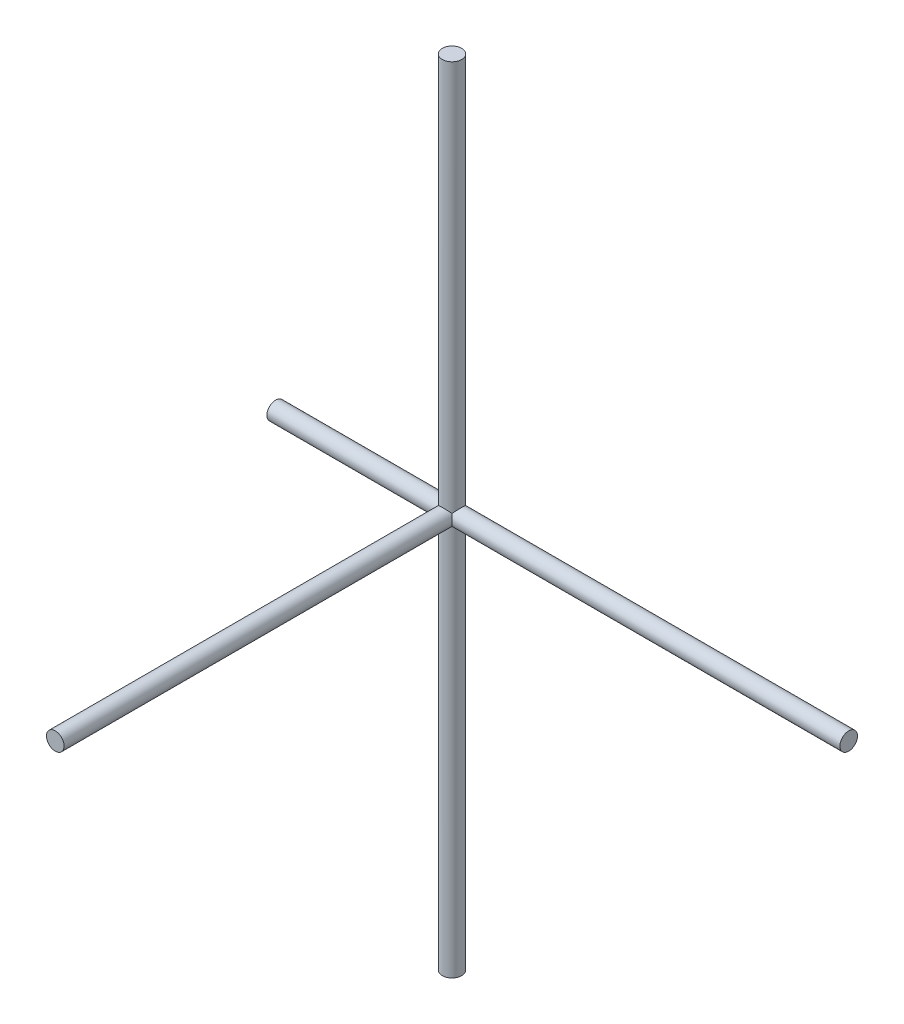
ISO-10303-21;
HEADER;
FILE_DESCRIPTION(('STEP AP214'),'2;1');
FILE_NAME('part.step','',(''),(''),'','','');
FILE_SCHEMA(('AUTOMOTIVE_DESIGN { 1 0 10303 214 1 1 1 1 }'));
ENDSEC;
DATA;
#1=APPLICATION_CONTEXT('core data for automotive mechanical design processes');
#2=APPLICATION_PROTOCOL_DEFINITION('international standard','automotive_design',2000,#1);
#3=PRODUCT_CONTEXT('',#1,'mechanical');
#4=PRODUCT('Part','Part','',(#3));
#5=PRODUCT_RELATED_PRODUCT_CATEGORY('part','',(#4));
#6=PRODUCT_DEFINITION_FORMATION('','',#4);
#7=PRODUCT_DEFINITION_CONTEXT('part definition',#1,'design');
#8=PRODUCT_DEFINITION('design','',#6,#7);
#9=PRODUCT_DEFINITION_SHAPE('','',#8);
#10=(LENGTH_UNIT() NAMED_UNIT(*) SI_UNIT(.MILLI.,.METRE.));
#11=(NAMED_UNIT(*) PLANE_ANGLE_UNIT() SI_UNIT($,.RADIAN.));
#12=(NAMED_UNIT(*) SI_UNIT($,.STERADIAN.) SOLID_ANGLE_UNIT());
#13=UNCERTAINTY_MEASURE_WITH_UNIT(LENGTH_MEASURE(1.E-05),#10,'distance_accuracy_value','');
#14=(GEOMETRIC_REPRESENTATION_CONTEXT(3) GLOBAL_UNCERTAINTY_ASSIGNED_CONTEXT((#13)) GLOBAL_UNIT_ASSIGNED_CONTEXT((#10,
#11,#12)) REPRESENTATION_CONTEXT('',''));
#15=CARTESIAN_POINT('',(0.,0.,0.));
#16=DIRECTION('',(0.,0.,1.));
#17=DIRECTION('',(1.,0.,0.));
#18=AXIS2_PLACEMENT_3D('',#15,#16,#17);
#19=CARTESIAN_POINT('',(0.,180.,0.));
#20=DIRECTION('',(0.,-1.,0.));
#21=DIRECTION('',(0.,0.,-1.));
#22=AXIS2_PLACEMENT_3D('',#19,#20,#21);
#23=CYLINDRICAL_SURFACE('',#22,4.4);
#24=CARTESIAN_POINT('',(0.,180.,0.));
#25=DIRECTION('',(0.,1.,0.));
#26=DIRECTION('',(0.,0.,1.));
#27=AXIS2_PLACEMENT_3D('',#24,#25,#26);
#28=CIRCLE('',#27,4.4);
#29=CARTESIAN_POINT('',(0.,180.,4.4));
#30=VERTEX_POINT('',#29);
#31=EDGE_CURVE('E115',#30,#30,#28,.T.);
#32=ORIENTED_EDGE('',*,*,#31,.F.);
#33=EDGE_LOOP('',(#32));
#34=FACE_BOUND('',#33,.T.);
#35=CARTESIAN_POINT('',(0.,-180.,0.));
#36=DIRECTION('',(0.,-1.,0.));
#37=DIRECTION('',(0.,0.,-1.));
#38=AXIS2_PLACEMENT_3D('',#35,#36,#37);
#39=CIRCLE('',#38,4.4);
#40=CARTESIAN_POINT('',(0.,-180.,-4.4));
#41=VERTEX_POINT('',#40);
#42=EDGE_CURVE('E73',#41,#41,#39,.T.);
#43=ORIENTED_EDGE('',*,*,#42,.F.);
#44=EDGE_LOOP('',(#43));
#45=FACE_BOUND('',#44,.T.);
#46=CARTESIAN_POINT('',(-4.,0.,1.83303027798231));
#47=CARTESIAN_POINT('',(-4.0000009064068,-0.0582547253777996,1.83302693428974));
#48=CARTESIAN_POINT('',(-3.99872300476309,-0.116498835997208,1.83582459587142));
#49=CARTESIAN_POINT('',(-3.99366624314689,-0.232376663541049,1.8467986720908));
#50=CARTESIAN_POINT('',(-3.98988635948926,-0.290010120806262,1.85497728833613));
#51=CARTESIAN_POINT('',(-3.97493990227582,-0.461539164527482,1.88690581106871));
#52=CARTESIAN_POINT('',(-3.96016743068864,-0.573781619647588,1.91804447045867));
#53=CARTESIAN_POINT('',(-3.92718380425481,-0.764286424533902,1.98449504210569));
#54=CARTESIAN_POINT('',(-3.9107661416553,-0.844007007246676,2.0167982444488));
#55=CARTESIAN_POINT('',(-3.87379981801204,-1.00004635536103,2.08692358310449));
#56=CARTESIAN_POINT('',(-3.85324828152543,-1.07636270744992,2.12474955590099));
#57=CARTESIAN_POINT('',(-3.80828169144484,-1.22601835877853,2.20433331346027));
#58=CARTESIAN_POINT('',(-3.78385484380841,-1.29934768223332,2.24610293781991));
#59=CARTESIAN_POINT('',(-3.73138029299657,-1.44314039221838,2.33224183435219));
#60=CARTESIAN_POINT('',(-3.70333138843764,-1.51360281759665,2.37661196639656));
#61=CARTESIAN_POINT('',(-3.62097751193017,-1.70475545443436,2.50152109903136));
#62=CARTESIAN_POINT('',(-3.56297577326942,-1.82272277278865,2.58381190831586));
#63=CARTESIAN_POINT('',(-3.43628678737624,-2.05159311399536,2.75007257293825));
#64=CARTESIAN_POINT('',(-3.36759244900991,-2.16249137948932,2.83404351006642));
#65=CARTESIAN_POINT('',(-3.21952686076511,-2.37731690339869,3.00118221146937));
#66=CARTESIAN_POINT('',(-3.14016869167355,-2.4812524721603,3.08435082802207));
#67=CARTESIAN_POINT('',(-2.97057206898996,-2.68196816640762,3.24801423920368));
#68=CARTESIAN_POINT('',(-2.88033927485734,-2.77875197192497,3.32851039707039));
#69=CARTESIAN_POINT('',(-2.64031210540659,-3.01149397929789,3.52468536741589));
#70=CARTESIAN_POINT('',(-2.48342508554514,-3.14260062235448,3.6376404089944));
#71=CARTESIAN_POINT('',(-2.14431969323304,-3.38303946981537,3.84727632173302));
#72=CARTESIAN_POINT('',(-1.96214601905304,-3.49240928567152,3.94398525800698));
#73=CARTESIAN_POINT('',(-1.6124771155525,-3.66468245693967,4.09740041206714));
#74=CARTESIAN_POINT('',(-1.44927162816953,-3.73250130531921,4.15823730813624));
#75=CARTESIAN_POINT('',(-1.19498134757178,-3.81838389830929,4.2355523571241));
#76=CARTESIAN_POINT('',(-1.10861225740485,-3.8443755017158,4.25900523613052));
#77=CARTESIAN_POINT('',(-0.933182844029355,-3.89067929929777,4.30084714434486));
#78=CARTESIAN_POINT('',(-0.844123704647069,-3.91099395254751,4.31923836604937));
#79=CARTESIAN_POINT('',(-0.663277926784768,-3.94570641933989,4.35069477861847));
#80=CARTESIAN_POINT('',(-0.571476769281739,-3.96006268955726,4.36372256940392));
#81=CARTESIAN_POINT('',(-0.386504440922734,-3.98237220176264,4.38397838586888));
#82=CARTESIAN_POINT('',(-0.293333908416377,-3.99032833651785,4.39120903176777));
#83=CARTESIAN_POINT('',(-0.106392026561915,-3.9996791215379,4.39970782487565));
#84=CARTESIAN_POINT('',(-0.0126207203066331,-4.00107423725576,4.4009763950473));
#85=CARTESIAN_POINT('',(0.174648345134753,-3.99728478483526,4.39753183340181));
#86=CARTESIAN_POINT('',(0.26814612413732,-3.99210070580248,4.39281914623883));
#87=CARTESIAN_POINT('',(0.528034005305719,-3.9685224978891,4.37139826852543));
#88=CARTESIAN_POINT('',(0.693319880677732,-3.94290542711561,4.34813452752423));
#89=CARTESIAN_POINT('',(1.01606452214825,-3.87233641161804,4.28424666194945));
#90=CARTESIAN_POINT('',(1.1735217633664,-3.82738071640166,4.24361916989624));
#91=CARTESIAN_POINT('',(1.48528900946328,-3.71786870582873,4.14511058896241));
#92=CARTESIAN_POINT('',(1.63905229588977,-3.65244818459105,4.08647138951271));
#93=CARTESIAN_POINT('',(1.93275693060082,-3.50591607708973,3.95605177826817));
#94=CARTESIAN_POINT('',(2.07269302169469,-3.42479855713679,3.88426639758146));
#95=CARTESIAN_POINT('',(2.40795769200959,-3.20323136694707,3.69004690239265));
#96=CARTESIAN_POINT('',(2.59366874000576,-3.05402674798065,3.56084287879736));
#97=CARTESIAN_POINT('',(2.84672408307263,-2.81244785400204,3.35678830272299));
#98=CARTESIAN_POINT('',(2.9269711168161,-2.72875724578807,3.28689812478142));
#99=CARTESIAN_POINT('',(3.07909542286397,-2.55585860853849,3.14483295895604));
#100=CARTESIAN_POINT('',(3.15097441262345,-2.46665171743847,3.07265844379025));
#101=CARTESIAN_POINT('',(3.28813897081627,-2.28075043902642,2.92549335489772));
#102=CARTESIAN_POINT('',(3.35321984832724,-2.18392615241833,2.8504771109688));
#103=CARTESIAN_POINT('',(3.47487182674633,-1.98466642575039,2.70084381920219));
#104=CARTESIAN_POINT('',(3.53143835234012,-1.88222800889739,2.62622700662705));
#105=CARTESIAN_POINT('',(3.63582587822291,-1.67168863642704,2.47968364391782));
#106=CARTESIAN_POINT('',(3.68367363805609,-1.5636063632393,2.40774942011471));
#107=CARTESIAN_POINT('',(3.77051707807342,-1.34070780188681,2.26932667941261));
#108=CARTESIAN_POINT('',(3.80952391369835,-1.22590023259947,2.20283136823157));
#109=CARTESIAN_POINT('',(3.87275749125731,-1.00634325357754,2.08933186901962));
#110=CARTESIAN_POINT('',(3.8983318468561,-0.902736947080173,2.04090194208412));
#111=CARTESIAN_POINT('',(3.94166676513769,-0.689249858874877,1.95589949703241));
#112=CARTESIAN_POINT('',(3.95944562828114,-0.57938446403868,1.91929926161703));
#113=CARTESIAN_POINT('',(3.98379792876954,-0.372045368675328,1.8681665239108));
#114=CARTESIAN_POINT('',(3.99170754441923,-0.275395164974736,1.85104306218778));
#115=CARTESIAN_POINT('',(4.00038037047788,-0.0803165811063175,1.8322341081913));
#116=CARTESIAN_POINT('',(4.00115295592569,0.0181092961411579,1.83052836362246));
#117=CARTESIAN_POINT('',(3.99549218482547,0.213550928807198,1.842844273472));
#118=CARTESIAN_POINT('',(3.98906929030227,0.31056852430867,1.85684309393725));
#119=CARTESIAN_POINT('',(3.9696444045941,0.501143541119369,1.89800393765792));
#120=CARTESIAN_POINT('',(3.95662911894926,0.594693558844362,1.92519255524897));
#121=CARTESIAN_POINT('',(3.92674532947885,0.766382000176334,1.9853606674687));
#122=CARTESIAN_POINT('',(3.91052196489324,0.845027368296172,2.01726197751953));
#123=CARTESIAN_POINT('',(3.87405330124182,0.998986713135292,2.08644219527937));
#124=CARTESIAN_POINT('',(3.85380464727298,1.07429784646196,2.12372558156786));
#125=CARTESIAN_POINT('',(3.80952923265124,1.22207188323261,2.20216321418704));
#126=CARTESIAN_POINT('',(3.78548887744139,1.29452331778502,2.24333116602588));
#127=CARTESIAN_POINT('',(3.73387500729124,1.4366242010411,2.32822948455198));
#128=CARTESIAN_POINT('',(3.7063002630338,1.50627266369831,2.37196073991149));
#129=CARTESIAN_POINT('',(3.62476296959283,1.69668545004119,2.49601981906803));
#130=CARTESIAN_POINT('',(3.56706746745848,1.81469372105905,2.57814809177486));
#131=CARTESIAN_POINT('',(3.44101276609447,2.0436493719942,2.74414572712216));
#132=CARTESIAN_POINT('',(3.37264624654545,2.15459183064896,2.82801625045039));
#133=CARTESIAN_POINT('',(3.22525974769762,2.36952537996851,2.99501015443633));
#134=CARTESIAN_POINT('',(3.14625232802619,2.47352445278834,3.07813429451665));
#135=CARTESIAN_POINT('',(2.97738577377823,2.67439322378897,3.24175940606599));
#136=CARTESIAN_POINT('',(2.88753230821627,2.77126660417932,3.32226172021006));
#137=CARTESIAN_POINT('',(2.64797592495654,3.00478501237786,3.51894416622786));
#138=CARTESIAN_POINT('',(2.49110728277923,3.1365416858262,3.63240089414714));
#139=CARTESIAN_POINT('',(2.15190758088378,3.37824252684358,3.84305315120509));
#140=CARTESIAN_POINT('',(1.96962231742803,3.48822508364118,3.94027725125858));
#141=CARTESIAN_POINT('',(1.61982792229444,3.66144403598067,4.09450263305625));
#142=CARTESIAN_POINT('',(1.45665850981044,3.72963052846479,4.15565959514773));
#143=CARTESIAN_POINT('',(1.2023634720258,3.81606720419732,4.23346370070393));
#144=CARTESIAN_POINT('',(1.11598258295757,3.84224406784319,4.25708120967922));
#145=CARTESIAN_POINT('',(0.940508409956585,3.88891656992465,4.29925239811209));
#146=CARTESIAN_POINT('',(0.851416320500683,3.9094146711665,4.3178082726816));
#147=CARTESIAN_POINT('',(0.670477121612181,3.9444914123909,4.34959276619101));
#148=CARTESIAN_POINT('',(0.578615226225647,3.95902815898006,4.36278367773091));
#149=CARTESIAN_POINT('',(0.393498481690312,3.98168937414396,4.3833580396716));
#150=CARTESIAN_POINT('',(0.300244283313359,3.98981674845478,4.39074412172933));
#151=CARTESIAN_POINT('',(0.11311417441391,3.99949703863457,4.3995422666253));
#152=CARTESIAN_POINT('',(0.0192383146839537,4.00105048514413,4.40095481164122));
#153=CARTESIAN_POINT('',(-0.168258750457593,3.99756145113243,4.39778333123838));
#154=CARTESIAN_POINT('',(-0.26187997455954,3.99251946856932,4.39319975852948));
#155=CARTESIAN_POINT('',(-0.521988485334404,3.96932496981529,4.37212694563592));
#156=CARTESIAN_POINT('',(-0.687391645479312,3.94394689928984,4.34907929705741));
#157=CARTESIAN_POINT('',(-1.01040995466865,3.8738193904148,4.28558744596143));
#158=CARTESIAN_POINT('',(-1.1680236131078,3.82906626030742,4.24513992805171));
#159=CARTESIAN_POINT('',(-1.47996626138516,3.71998735605148,4.14701168606951));
#160=CARTESIAN_POINT('',(-1.63376187056665,3.65481485595265,4.088587914549));
#161=CARTESIAN_POINT('',(-1.92757046083454,3.50876749378923,3.95858003963871));
#162=CARTESIAN_POINT('',(-2.06757796153374,3.42788642566792,3.88699073547657));
#163=CARTESIAN_POINT('',(-2.40293696231474,3.20698195124423,3.69330777932557));
#164=CARTESIAN_POINT('',(-2.58870820549332,3.05821469237239,3.56444361057131));
#165=CARTESIAN_POINT('',(-2.84190305604172,2.81731383700085,3.3608684408656));
#166=CARTESIAN_POINT('',(-2.92220050117417,2.73385957038152,3.29113828030298));
#167=CARTESIAN_POINT('',(-3.07444734128673,2.5614416165458,3.14937526023141));
#168=CARTESIAN_POINT('',(-3.14639841860995,2.47247904517997,3.07734286852048));
#169=CARTESIAN_POINT('',(-3.28371186912558,2.28711021123927,2.93045936787914));
#170=CARTESIAN_POINT('',(-3.34887237093868,2.19057582194963,2.85558225014342));
#171=CARTESIAN_POINT('',(-3.47071061308133,1.99192198787995,2.70618796426039));
#172=CARTESIAN_POINT('',(-3.52738393915977,1.88979967421385,2.63167100279629));
#173=CARTESIAN_POINT('',(-3.63204899766815,1.67986698450638,2.48521478020733));
#174=CARTESIAN_POINT('',(-3.68006237502356,1.57207168491122,2.41326946313914));
#175=CARTESIAN_POINT('',(-3.76726905855426,1.34978637677563,2.27472099951009));
#176=CARTESIAN_POINT('',(-3.80647307354854,1.2353047120491,2.20811143083309));
#177=CARTESIAN_POINT('',(-3.87197300628267,1.01004882253911,2.09090189873204));
#178=CARTESIAN_POINT('',(-3.89916332368421,0.900032315344426,2.03936942189621));
#179=CARTESIAN_POINT('',(-3.9446656668512,0.672973575654901,1.94990953653718));
#180=CARTESIAN_POINT('',(-3.96301105288484,0.555959643506135,1.91193114943567));
#181=CARTESIAN_POINT('',(-3.98397436810502,0.364810189588748,1.86769495240306));
#182=CARTESIAN_POINT('',(-3.98995411967559,0.292583075084967,1.85481831629633));
#183=CARTESIAN_POINT('',(-3.99796529019786,0.146897889206306,1.83749037870874));
#184=CARTESIAN_POINT('',(-3.99999885731197,0.0734405095240089,1.83303449330535));
#185=CARTESIAN_POINT('',(-4.,0.,1.83303027798231));
#186=B_SPLINE_CURVE_WITH_KNOTS('',3,(#46,#47,#48,#49,#50,#51,#52,#53,#54,#55,#56,#57,#58,#59,
#60,#61,#62,#63,#64,#65,#66,#67,#68,#69,#70,#71,#72,#73,#74,#75,#76,#77,#78,#79,#80,#81,#82,#83,
#84,#85,#86,#87,#88,#89,#90,#91,#92,#93,#94,#95,#96,#97,#98,#99,#100,#101,#102,#103,#104,#105,
#106,#107,#108,#109,#110,#111,#112,#113,#114,#115,#116,#117,#118,#119,#120,#121,#122,#123,#124,
#125,#126,#127,#128,#129,#130,#131,#132,#133,#134,#135,#136,#137,#138,#139,#140,#141,#142,#143,
#144,#145,#146,#147,#148,#149,#150,#151,#152,#153,#154,#155,#156,#157,#158,#159,#160,#161,#162,
#163,#164,#165,#166,#167,#168,#169,#170,#171,#172,#173,#174,#175,#176,#177,#178,#179,#180,#181,
#182,#183,#184,#185),.UNSPECIFIED.,.T.,.F.,(4,2,2,2,2,2,2,2,2,2,2,2,2,2,2,2,2,2,2,2,2,2,2,2,2,2,
2,2,2,2,2,2,2,2,2,2,2,2,2,2,2,2,2,2,2,2,2,2,2,2,2,2,2,2,2,2,2,2,2,2,2,2,2,2,2,2,2,2,2,4),(0.,
0.174663765603157,0.349399039040846,0.699700253833684,0.962085472689045,1.22465383672734,
1.48803719157583,1.75150813232002,2.21612530067802,2.68105191774439,3.14541335180286,
3.6095341543666,4.30765782387746,5.00456279993498,5.56282596134724,5.84211281746289,
6.12127850720354,6.40235917469084,6.683312726351,6.96424634625205,7.24515908241938,
7.74925160905876,8.25344194245288,8.78272718381406,9.31221289477239,10.1204214479049,
10.5263021505491,10.9320994029396,11.3478389582476,11.7638011259204,12.1784642948318,
12.5926012939936,12.9434667444217,13.2935040452859,13.5876337051398,13.8813769480054,
14.1746936501608,14.4686042348022,14.7274424011082,14.9864972090921,15.246502864744,
15.5065992011855,15.970705235856,16.4351310580591,16.8990134379476,17.3626543970848,
18.0625567901718,18.7612139988752,19.320097292903,19.5996967834963,19.8791748248812,
20.1605845628492,20.4418666481819,20.7231260282849,21.0043641743915,21.5085992524392,
22.0129304506368,22.5418119290218,23.0709027816679,23.8780333109553,24.2833185048935,
24.6885218646847,25.1035427031115,25.5187786532189,25.9329619168208,26.3466389347477,
26.7193026471473,27.0905495761307,27.3108644845334,27.5310594276576),.UNSPECIFIED.);
#187=CARTESIAN_POINT('',(-3.11126983722079,-2.51396101799528,3.11126983722083));
#188=VERTEX_POINT('',#187);
#189=CARTESIAN_POINT('',(3.11126983722081,-2.51396101799531,3.11126983722081));
#190=VERTEX_POINT('',#189);
#191=EDGE_CURVE('E54',#188,#190,#186,.T.);
#192=ORIENTED_EDGE('',*,*,#191,.F.);
#193=CARTESIAN_POINT('',(-1.83303027798232,0.,-4.));
#194=CARTESIAN_POINT('',(-1.83302693428975,0.0582547253778021,-4.0000009064068));
#195=CARTESIAN_POINT('',(-1.83582459587143,0.116498835997212,-3.99872300476309));
#196=CARTESIAN_POINT('',(-1.8467986720908,0.232376663541058,-3.99366624314689));
#197=CARTESIAN_POINT('',(-1.85497728833613,0.290010120806272,-3.98988635948926));
#198=CARTESIAN_POINT('',(-1.88690581106872,0.461539164527496,-3.97493990227582));
#199=CARTESIAN_POINT('',(-1.91804447045868,0.573781619647605,-3.96016743068864));
#200=CARTESIAN_POINT('',(-1.9844950421057,0.764286424533927,-3.9271838042548));
#201=CARTESIAN_POINT('',(-2.01679824444882,0.844007007246707,-3.9107661416553));
#202=CARTESIAN_POINT('',(-2.08692358310451,1.00004635536107,-3.87379981801203));
#203=CARTESIAN_POINT('',(-2.12474955590102,1.07636270744997,-3.85324828152541));
#204=CARTESIAN_POINT('',(-2.2043333134603,1.22601835877858,-3.80828169144482));
#205=CARTESIAN_POINT('',(-2.24610293781995,1.29934768223338,-3.78385484380839));
#206=CARTESIAN_POINT('',(-2.33224183435223,1.44314039221846,-3.73138029299654));
#207=CARTESIAN_POINT('',(-2.37661196639661,1.51360281759673,-3.70333138843761));
#208=CARTESIAN_POINT('',(-2.50152109903142,1.70475545443445,-3.62097751193013));
#209=CARTESIAN_POINT('',(-2.58381190831593,1.82272277278875,-3.56297577326937));
#210=CARTESIAN_POINT('',(-2.75007257293833,2.05159311399546,-3.43628678737618));
#211=CARTESIAN_POINT('',(-2.8340435100665,2.16249137948943,-3.36759244900984));
#212=CARTESIAN_POINT('',(-3.00118221146946,2.37731690339881,-3.21952686076503));
#213=CARTESIAN_POINT('',(-3.08435082802217,2.48125247216042,-3.14016869167345));
#214=CARTESIAN_POINT('',(-3.24801423920379,2.68196816640774,-2.97057206898984));
#215=CARTESIAN_POINT('',(-3.3285103970705,2.7787519719251,-2.88033927485721));
#216=CARTESIAN_POINT('',(-3.52468536741599,3.01149397929801,-2.64031210540645));
#217=CARTESIAN_POINT('',(-3.6376404089945,3.14260062235458,-2.483425085545));
#218=CARTESIAN_POINT('',(-3.84727632173309,3.38303946981545,-2.14431969323291));
#219=CARTESIAN_POINT('',(-3.94398525800705,3.49240928567159,-1.96214601905291));
#220=CARTESIAN_POINT('',(-4.09740041206719,3.66468245693972,-1.61247711555238));
#221=CARTESIAN_POINT('',(-4.15823730813628,3.73250130531925,-1.44927162816941));
#222=CARTESIAN_POINT('',(-4.23555235712413,3.81838389830932,-1.19498134757166));
#223=CARTESIAN_POINT('',(-4.25900523613055,3.84437550171584,-1.10861225740473));
#224=CARTESIAN_POINT('',(-4.30084714434489,3.8906792992978,-0.933182844029235));
#225=CARTESIAN_POINT('',(-4.31923836604939,3.91099395254753,-0.84412370464695));
#226=CARTESIAN_POINT('',(-4.35069477861849,3.94570641933991,-0.663277926784651));
#227=CARTESIAN_POINT('',(-4.36372256940393,3.96006268955728,-0.571476769281624));
#228=CARTESIAN_POINT('',(-4.38397838586889,3.98237220176265,-0.386504440922622));
#229=CARTESIAN_POINT('',(-4.39120903176778,3.99032833651785,-0.293333908416266));
#230=CARTESIAN_POINT('',(-4.39970782487565,3.9996791215379,-0.106392026561807));
#231=CARTESIAN_POINT('',(-4.4009763950473,4.00107423725576,-0.0126207203065279));
#232=CARTESIAN_POINT('',(-4.39753183340181,3.99728478483526,0.174648345134854));
#233=CARTESIAN_POINT('',(-4.39281914623883,3.99210070580247,0.268146124137419));
#234=CARTESIAN_POINT('',(-4.37139826852541,3.96852249788908,0.528034005305813));
#235=CARTESIAN_POINT('',(-4.34813452752422,3.94290542711559,0.693319880677824));
#236=CARTESIAN_POINT('',(-4.28424666194943,3.87233641161802,1.01606452214833));
#237=CARTESIAN_POINT('',(-4.24361916989622,3.82738071640164,1.17352176336648));
#238=CARTESIAN_POINT('',(-4.14511058896238,3.71786870582869,1.48528900946336));
#239=CARTESIAN_POINT('',(-4.08647138951268,3.65244818459101,1.63905229588984));
#240=CARTESIAN_POINT('',(-3.95605177826813,3.50591607708969,1.9327569306009));
#241=CARTESIAN_POINT('',(-3.88426639758142,3.42479855713674,2.07269302169476));
#242=CARTESIAN_POINT('',(-3.6900469023926,3.20323136694701,2.40795769200967));
#243=CARTESIAN_POINT('',(-3.56084287879731,3.05402674798059,2.59366874000583));
#244=CARTESIAN_POINT('',(-3.35678830272293,2.81244785400197,2.8467240830727));
#245=CARTESIAN_POINT('',(-3.28689812478136,2.72875724578799,2.92697111681617));
#246=CARTESIAN_POINT('',(-3.14483295895598,2.55585860853841,3.07909542286404));
#247=CARTESIAN_POINT('',(-3.07265844379018,2.46665171743838,3.15097441262352));
#248=CARTESIAN_POINT('',(-2.92549335489765,2.28075043902633,3.28813897081633));
#249=CARTESIAN_POINT('',(-2.85047711096872,2.18392615241823,3.3532198483273));
#250=CARTESIAN_POINT('',(-2.70084381920211,1.98466642575028,3.4748718267464));
#251=CARTESIAN_POINT('',(-2.62622700662697,1.88222800889728,3.53143835234018));
#252=CARTESIAN_POINT('',(-2.47968364391774,1.67168863642692,3.63582587822297));
#253=CARTESIAN_POINT('',(-2.40774942011462,1.56360636323917,3.68367363805615));
#254=CARTESIAN_POINT('',(-2.26932667941253,1.34070780188666,3.77051707807347));
#255=CARTESIAN_POINT('',(-2.20283136823148,1.22590023259932,3.8095239136984));
#256=CARTESIAN_POINT('',(-2.08933186901954,1.00634325357738,3.87275749125735));
#257=CARTESIAN_POINT('',(-2.04090194208405,0.902736947080019,3.89833184685613));
#258=CARTESIAN_POINT('',(-1.95589949703236,0.689249858874728,3.94166676513771));
#259=CARTESIAN_POINT('',(-1.91929926161699,0.579384464038534,3.95944562828116));
#260=CARTESIAN_POINT('',(-1.86816652391077,0.372045368675188,3.98379792876955));
#261=CARTESIAN_POINT('',(-1.85104306218776,0.275395164974599,3.99170754441924));
#262=CARTESIAN_POINT('',(-1.8322341081913,0.0803165811061879,4.00038037047788));
#263=CARTESIAN_POINT('',(-1.83052836362247,-0.0181092961412832,4.00115295592569));
#264=CARTESIAN_POINT('',(-1.84284427347202,-0.213550928807313,3.99549218482547));
#265=CARTESIAN_POINT('',(-1.85684309393727,-0.310568524308779,3.98906929030226));
#266=CARTESIAN_POINT('',(-1.89800393765794,-0.501143541119465,3.96964440459408));
#267=CARTESIAN_POINT('',(-1.925192555249,-0.594693558844452,3.95662911894925));
#268=CARTESIAN_POINT('',(-1.98536066746873,-0.766382000176417,3.92674532947883));
#269=CARTESIAN_POINT('',(-2.01726197751957,-0.845027368296254,3.91052196489323));
#270=CARTESIAN_POINT('',(-2.08644219527941,-0.99898671313537,3.8740533012418));
#271=CARTESIAN_POINT('',(-2.1237255815679,-1.07429784646204,3.85380464727296));
#272=CARTESIAN_POINT('',(-2.20216321418708,-1.22207188323269,3.80952923265122));
#273=CARTESIAN_POINT('',(-2.24333116602593,-1.29452331778509,3.78548887744136));
#274=CARTESIAN_POINT('',(-2.32822948455202,-1.43662420104117,3.73387500729121));
#275=CARTESIAN_POINT('',(-2.37196073991153,-1.50627266369838,3.70630026303377));
#276=CARTESIAN_POINT('',(-2.49601981906807,-1.69668545004125,3.6247629695928));
#277=CARTESIAN_POINT('',(-2.5781480917749,-1.81469372105911,3.56706746745845));
#278=CARTESIAN_POINT('',(-2.7441457271222,-2.04364937199425,3.44101276609444));
#279=CARTESIAN_POINT('',(-2.82801625045043,-2.15459183064901,3.37264624654542));
#280=CARTESIAN_POINT('',(-2.99501015443637,-2.36952537996855,3.2252597476976));
#281=CARTESIAN_POINT('',(-3.07813429451668,-2.47352445278838,3.14625232802616));
#282=CARTESIAN_POINT('',(-3.24175940606601,-2.674393223789,2.97738577377821));
#283=CARTESIAN_POINT('',(-3.32226172021008,-2.77126660417935,2.88753230821624));
#284=CARTESIAN_POINT('',(-3.51894416622788,-3.00478501237789,2.64797592495651));
#285=CARTESIAN_POINT('',(-3.63240089414716,-3.13654168582623,2.4911072827792));
#286=CARTESIAN_POINT('',(-3.84305315120511,-3.37824252684361,2.15190758088375));
#287=CARTESIAN_POINT('',(-3.9402772512586,-3.4882250836412,1.96962231742799));
#288=CARTESIAN_POINT('',(-4.09450263305627,-3.66144403598069,1.6198279222944));
#289=CARTESIAN_POINT('',(-4.15565959514775,-3.72963052846481,1.4566585098104));
#290=CARTESIAN_POINT('',(-4.23346370070394,-3.81606720419734,1.20236347202575));
#291=CARTESIAN_POINT('',(-4.25708120967923,-3.84224406784321,1.11598258295752));
#292=CARTESIAN_POINT('',(-4.29925239811211,-3.88891656992466,0.940508409956531));
#293=CARTESIAN_POINT('',(-4.31780827268161,-3.90941467116651,0.851416320500628));
#294=CARTESIAN_POINT('',(-4.34959276619102,-3.94449141239091,0.670477121612126));
#295=CARTESIAN_POINT('',(-4.36278367773092,-3.95902815898007,0.578615226225592));
#296=CARTESIAN_POINT('',(-4.38335803967161,-3.98168937414397,0.393498481690255));
#297=CARTESIAN_POINT('',(-4.39074412172933,-3.98981674845479,0.3002442833133));
#298=CARTESIAN_POINT('',(-4.39954226662531,-3.99949703863457,0.113114174413848));
#299=CARTESIAN_POINT('',(-4.40095481164122,-4.00105048514413,0.019238314683889));
#300=CARTESIAN_POINT('',(-4.39778333123838,-3.99756145113243,-0.16825875045766));
#301=CARTESIAN_POINT('',(-4.39319975852947,-3.99251946856932,-0.261879974559606));
#302=CARTESIAN_POINT('',(-4.37212694563591,-3.96932496981528,-0.521988485334474));
#303=CARTESIAN_POINT('',(-4.3490792970574,-3.94394689928983,-0.687391645479385));
#304=CARTESIAN_POINT('',(-4.28558744596141,-3.87381939041478,-1.01040995466873));
#305=CARTESIAN_POINT('',(-4.24513992805169,-3.8290662603074,-1.16802361310788));
#306=CARTESIAN_POINT('',(-4.14701168606948,-3.71998735605145,-1.47996626138524));
#307=CARTESIAN_POINT('',(-4.08858791454897,-3.65481485595261,-1.63376187056673));
#308=CARTESIAN_POINT('',(-3.95858003963867,-3.50876749378919,-1.92757046083462));
#309=CARTESIAN_POINT('',(-3.88699073547652,-3.42788642566787,-2.06757796153382));
#310=CARTESIAN_POINT('',(-3.69330777932551,-3.20698195124416,-2.40293696231482));
#311=CARTESIAN_POINT('',(-3.56444361057124,-3.05821469237232,-2.5887082054934));
#312=CARTESIAN_POINT('',(-3.36086844086553,-2.81731383700077,-2.84190305604181));
#313=CARTESIAN_POINT('',(-3.2911382803029,-2.73385957038143,-2.92220050117425));
#314=CARTESIAN_POINT('',(-3.14937526023133,-2.5614416165457,-3.07444734128682));
#315=CARTESIAN_POINT('',(-3.0773428685204,-2.47247904517987,-3.14639841861003));
#316=CARTESIAN_POINT('',(-2.93045936787906,-2.28711021123916,-3.28371186912566));
#317=CARTESIAN_POINT('',(-2.85558225014333,-2.19057582194951,-3.34887237093876));
#318=CARTESIAN_POINT('',(-2.7061879642603,-1.99192198787982,-3.4707106130814));
#319=CARTESIAN_POINT('',(-2.63167100279619,-1.88979967421371,-3.52738393915984));
#320=CARTESIAN_POINT('',(-2.48521478020723,-1.67986698450624,-3.63204899766822));
#321=CARTESIAN_POINT('',(-2.41326946313904,-1.57207168491108,-3.68006237502362));
#322=CARTESIAN_POINT('',(-2.27472099950999,-1.34978637677547,-3.76726905855432));
#323=CARTESIAN_POINT('',(-2.20811143083299,-1.23530471204894,-3.80647307354859));
#324=CARTESIAN_POINT('',(-2.09090189873196,-1.01004882253895,-3.87197300628271));
#325=CARTESIAN_POINT('',(-2.03936942189615,-0.900032315344273,-3.89916332368424));
#326=CARTESIAN_POINT('',(-1.94990953653713,-0.67297357565477,-3.94466566685123));
#327=CARTESIAN_POINT('',(-1.91193114943563,-0.555959643506016,-3.96301105288486));
#328=CARTESIAN_POINT('',(-1.86769495240304,-0.364810189588659,-3.98397436810503));
#329=CARTESIAN_POINT('',(-1.85481831629631,-0.292583075084894,-3.9899541196756));
#330=CARTESIAN_POINT('',(-1.83749037870874,-0.146897889206268,-3.99796529019786));
#331=CARTESIAN_POINT('',(-1.83303449330536,-0.0734405095239901,-3.99999885731197));
#332=CARTESIAN_POINT('',(-1.83303027798232,0.,-4.));
#333=B_SPLINE_CURVE_WITH_KNOTS('',3,(#193,#194,#195,#196,#197,#198,#199,#200,#201,#202,#203,
#204,#205,#206,#207,#208,#209,#210,#211,#212,#213,#214,#215,#216,#217,#218,#219,#220,#221,#222,
#223,#224,#225,#226,#227,#228,#229,#230,#231,#232,#233,#234,#235,#236,#237,#238,#239,#240,#241,
#242,#243,#244,#245,#246,#247,#248,#249,#250,#251,#252,#253,#254,#255,#256,#257,#258,#259,#260,
#261,#262,#263,#264,#265,#266,#267,#268,#269,#270,#271,#272,#273,#274,#275,#276,#277,#278,#279,
#280,#281,#282,#283,#284,#285,#286,#287,#288,#289,#290,#291,#292,#293,#294,#295,#296,#297,#298,
#299,#300,#301,#302,#303,#304,#305,#306,#307,#308,#309,#310,#311,#312,#313,#314,#315,#316,#317,
#318,#319,#320,#321,#322,#323,#324,#325,#326,#327,#328,#329,#330,#331,#332),.UNSPECIFIED.,.T.,
.F.,(4,2,2,2,2,2,2,2,2,2,2,2,2,2,2,2,2,2,2,2,2,2,2,2,2,2,2,2,2,2,2,2,2,2,2,2,2,2,2,2,2,2,2,2,2,
2,2,2,2,2,2,2,2,2,2,2,2,2,2,2,2,2,2,2,2,2,2,2,2,4),(0.,0.174663765603164,0.349399039040857,
0.699700253833703,0.962085472689086,1.2246538367274,1.48803719157591,1.75150813232013,
2.21612530067815,2.68105191774455,3.14541335180306,3.60953415436682,4.30765782387764,
5.00456279993512,5.56282596134737,5.84211281746302,6.12127850720366,6.40235917469095,
6.68331272635111,6.96424634625216,7.24515908241948,7.74925160905886,8.25344194245297,
8.78272718381415,9.31221289477249,10.120421447905,10.5263021505492,10.9320994029397,
11.3478389582477,11.7638011259206,12.1784642948319,12.5926012939938,12.9434667444218,
13.2935040452861,13.5876337051399,13.8813769480055,14.1746936501609,14.4686042348023,
14.7274424011083,14.9864972090922,15.246502864744,15.5065992011856,15.9707052358561,
16.4351310580592,16.8990134379476,17.3626543970848,18.0625567901718,18.7612139988753,
19.320097292903,19.5996967834963,19.8791748248812,20.1605845628493,20.441866648182,
20.723126028285,21.0043641743916,21.5085992524393,22.0129304506369,22.5418119290219,
23.070902781668,23.8780333109555,24.2833185048936,24.6885218646849,25.1035427031116,
25.5187786532191,25.932961916821,26.3466389347479,26.7193026471475,27.0905495761308,
27.3108644845335,27.5310594276576),.UNSPECIFIED.);
#334=CARTESIAN_POINT('',(-3.11126983722079,2.51396101799528,3.11126983722083));
#335=VERTEX_POINT('',#334);
#336=EDGE_CURVE('E65',#188,#335,#333,.T.);
#337=ORIENTED_EDGE('',*,*,#336,.T.);
#338=CARTESIAN_POINT('',(3.11126983722081,2.51396101799531,3.11126983722081));
#339=VERTEX_POINT('',#338);
#340=EDGE_CURVE('E50',#339,#335,#186,.T.);
#341=ORIENTED_EDGE('',*,*,#340,.F.);
#342=CARTESIAN_POINT('',(1.83303027798231,0.,4.));
#343=CARTESIAN_POINT('',(1.83302693428974,-0.0582547253777995,4.0000009064068));
#344=CARTESIAN_POINT('',(1.83582459587143,-0.116498835997207,3.99872300476309));
#345=CARTESIAN_POINT('',(1.8467986720908,-0.232376663541049,3.99366624314689));
#346=CARTESIAN_POINT('',(1.85497728833613,-0.290010120806262,3.98988635948926));
#347=CARTESIAN_POINT('',(1.88690581106871,-0.461539164527482,3.97493990227582));
#348=CARTESIAN_POINT('',(1.91804447045867,-0.573781619647588,3.96016743068864));
#349=CARTESIAN_POINT('',(1.98449504210569,-0.764286424533902,3.92718380425481));
#350=CARTESIAN_POINT('',(2.0167982444488,-0.844007007246676,3.9107661416553));
#351=CARTESIAN_POINT('',(2.08692358310449,-1.00004635536103,3.87379981801204));
#352=CARTESIAN_POINT('',(2.12474955590099,-1.07636270744993,3.85324828152543));
#353=CARTESIAN_POINT('',(2.20433331346027,-1.22601835877853,3.80828169144484));
#354=CARTESIAN_POINT('',(2.24610293781991,-1.29934768223332,3.78385484380841));
#355=CARTESIAN_POINT('',(2.33224183435219,-1.44314039221838,3.73138029299657));
#356=CARTESIAN_POINT('',(2.37661196639656,-1.51360281759665,3.70333138843764));
#357=CARTESIAN_POINT('',(2.50152109903136,-1.70475545443436,3.62097751193017));
#358=CARTESIAN_POINT('',(2.58381190831586,-1.82272277278865,3.56297577326942));
#359=CARTESIAN_POINT('',(2.75007257293825,-2.05159311399536,3.43628678737624));
#360=CARTESIAN_POINT('',(2.83404351006642,-2.16249137948932,3.36759244900991));
#361=CARTESIAN_POINT('',(3.00118221146936,-2.37731690339869,3.21952686076511));
#362=CARTESIAN_POINT('',(3.08435082802207,-2.4812524721603,3.14016869167355));
#363=CARTESIAN_POINT('',(3.24801423920368,-2.68196816640761,2.97057206898996));
#364=CARTESIAN_POINT('',(3.32851039707039,-2.77875197192497,2.88033927485734));
#365=CARTESIAN_POINT('',(3.52468536741589,-3.01149397929789,2.64031210540659));
#366=CARTESIAN_POINT('',(3.6376404089944,-3.14260062235448,2.48342508554514));
#367=CARTESIAN_POINT('',(3.84727632173302,-3.38303946981537,2.14431969323304));
#368=CARTESIAN_POINT('',(3.94398525800699,-3.49240928567152,1.96214601905304));
#369=CARTESIAN_POINT('',(4.09740041206714,-3.66468245693967,1.6124771155525));
#370=CARTESIAN_POINT('',(4.15823730813624,-3.73250130531921,1.44927162816953));
#371=CARTESIAN_POINT('',(4.2355523571241,-3.81838389830929,1.19498134757178));
#372=CARTESIAN_POINT('',(4.25900523613051,-3.8443755017158,1.10861225740485));
#373=CARTESIAN_POINT('',(4.30084714434486,-3.89067929929777,0.933182844029355));
#374=CARTESIAN_POINT('',(4.31923836604937,-3.91099395254751,0.844123704647069));
#375=CARTESIAN_POINT('',(4.35069477861847,-3.94570641933989,0.663277926784768));
#376=CARTESIAN_POINT('',(4.36372256940392,-3.96006268955726,0.571476769281739));
#377=CARTESIAN_POINT('',(4.38397838586888,-3.98237220176264,0.386504440922734));
#378=CARTESIAN_POINT('',(4.39120903176777,-3.99032833651785,0.293333908416377));
#379=CARTESIAN_POINT('',(4.39970782487565,-3.9996791215379,0.106392026561914));
#380=CARTESIAN_POINT('',(4.4009763950473,-4.00107423725576,0.0126207203066327));
#381=CARTESIAN_POINT('',(4.39753183340181,-3.99728478483526,-0.174648345134753));
#382=CARTESIAN_POINT('',(4.39281914623883,-3.99210070580248,-0.26814612413732));
#383=CARTESIAN_POINT('',(4.37139826852543,-3.9685224978891,-0.528034005305719));
#384=CARTESIAN_POINT('',(4.34813452752423,-3.94290542711561,-0.693319880677732));
#385=CARTESIAN_POINT('',(4.28424666194945,-3.87233641161804,-1.01606452214825));
#386=CARTESIAN_POINT('',(4.24361916989624,-3.82738071640166,-1.1735217633664));
#387=CARTESIAN_POINT('',(4.14511058896241,-3.71786870582873,-1.48528900946328));
#388=CARTESIAN_POINT('',(4.08647138951271,-3.65244818459105,-1.63905229588977));
#389=CARTESIAN_POINT('',(3.95605177826817,-3.50591607708973,-1.93275693060082));
#390=CARTESIAN_POINT('',(3.88426639758146,-3.42479855713678,-2.07269302169469));
#391=CARTESIAN_POINT('',(3.69004690239265,-3.20323136694707,-2.4079576920096));
#392=CARTESIAN_POINT('',(3.56084287879736,-3.05402674798065,-2.59366874000576));
#393=CARTESIAN_POINT('',(3.35678830272299,-2.81244785400204,-2.84672408307263));
#394=CARTESIAN_POINT('',(3.28689812478142,-2.72875724578807,-2.9269711168161));
#395=CARTESIAN_POINT('',(3.14483295895604,-2.55585860853849,-3.07909542286398));
#396=CARTESIAN_POINT('',(3.07265844379025,-2.46665171743847,-3.15097441262345));
#397=CARTESIAN_POINT('',(2.92549335489772,-2.28075043902642,-3.28813897081627));
#398=CARTESIAN_POINT('',(2.85047711096879,-2.18392615241833,-3.35321984832724));
#399=CARTESIAN_POINT('',(2.70084381920219,-1.98466642575039,-3.47487182674633));
#400=CARTESIAN_POINT('',(2.62622700662705,-1.88222800889739,-3.53143835234012));
#401=CARTESIAN_POINT('',(2.47968364391782,-1.67168863642704,-3.63582587822291));
#402=CARTESIAN_POINT('',(2.40774942011471,-1.5636063632393,-3.68367363805609));
#403=CARTESIAN_POINT('',(2.26932667941261,-1.3407078018868,-3.77051707807342));
#404=CARTESIAN_POINT('',(2.20283136823157,-1.22590023259947,-3.80952391369835));
#405=CARTESIAN_POINT('',(2.08933186901961,-1.00634325357754,-3.87275749125731));
#406=CARTESIAN_POINT('',(2.04090194208412,-0.902736947080171,-3.8983318468561));
#407=CARTESIAN_POINT('',(1.95589949703241,-0.689249858874876,-3.94166676513769));
#408=CARTESIAN_POINT('',(1.91929926161703,-0.579384464038678,-3.95944562828114));
#409=CARTESIAN_POINT('',(1.8681665239108,-0.372045368675327,-3.98379792876954));
#410=CARTESIAN_POINT('',(1.85104306218778,-0.275395164974735,-3.99170754441923));
#411=CARTESIAN_POINT('',(1.8322341081913,-0.0803165811063164,-4.00038037047788));
#412=CARTESIAN_POINT('',(1.83052836362247,0.018109296141159,-4.00115295592569));
#413=CARTESIAN_POINT('',(1.84284427347201,0.213550928807199,-3.99549218482547));
#414=CARTESIAN_POINT('',(1.85684309393725,0.310568524308671,-3.98906929030227));
#415=CARTESIAN_POINT('',(1.89800393765792,0.501143541119369,-3.9696444045941));
#416=CARTESIAN_POINT('',(1.92519255524897,0.594693558844363,-3.95662911894926));
#417=CARTESIAN_POINT('',(1.9853606674687,0.766382000176334,-3.92674532947885));
#418=CARTESIAN_POINT('',(2.01726197751954,0.845027368296172,-3.91052196489324));
#419=CARTESIAN_POINT('',(2.08644219527937,0.998986713135291,-3.87405330124182));
#420=CARTESIAN_POINT('',(2.12372558156786,1.07429784646196,-3.85380464727298));
#421=CARTESIAN_POINT('',(2.20216321418704,1.22207188323261,-3.80952923265124));
#422=CARTESIAN_POINT('',(2.24333116602589,1.29452331778502,-3.78548887744139));
#423=CARTESIAN_POINT('',(2.32822948455198,1.4366242010411,-3.73387500729124));
#424=CARTESIAN_POINT('',(2.37196073991149,1.50627266369832,-3.7063002630338));
#425=CARTESIAN_POINT('',(2.49601981906803,1.69668545004119,-3.62476296959283));
#426=CARTESIAN_POINT('',(2.57814809177486,1.81469372105906,-3.56706746745848));
#427=CARTESIAN_POINT('',(2.74414572712216,2.0436493719942,-3.44101276609447));
#428=CARTESIAN_POINT('',(2.82801625045039,2.15459183064896,-3.37264624654545));
#429=CARTESIAN_POINT('',(2.99501015443634,2.36952537996851,-3.22525974769762));
#430=CARTESIAN_POINT('',(3.07813429451665,2.47352445278835,-3.14625232802619));
#431=CARTESIAN_POINT('',(3.24175940606599,2.67439322378897,-2.97738577377823));
#432=CARTESIAN_POINT('',(3.32226172021006,2.77126660417932,-2.88753230821627));
#433=CARTESIAN_POINT('',(3.51894416622786,3.00478501237786,-2.64797592495654));
#434=CARTESIAN_POINT('',(3.63240089414714,3.1365416858262,-2.49110728277923));
#435=CARTESIAN_POINT('',(3.84305315120509,3.37824252684358,-2.15190758088378));
#436=CARTESIAN_POINT('',(3.94027725125858,3.48822508364118,-1.96962231742803));
#437=CARTESIAN_POINT('',(4.09450263305625,3.66144403598067,-1.61982792229444));
#438=CARTESIAN_POINT('',(4.15565959514773,3.72963052846479,-1.45665850981044));
#439=CARTESIAN_POINT('',(4.23346370070393,3.81606720419732,-1.2023634720258));
#440=CARTESIAN_POINT('',(4.25708120967922,3.84224406784319,-1.11598258295757));
#441=CARTESIAN_POINT('',(4.29925239811209,3.88891656992465,-0.940508409956583));
#442=CARTESIAN_POINT('',(4.3178082726816,3.9094146711665,-0.851416320500681));
#443=CARTESIAN_POINT('',(4.34959276619101,3.9444914123909,-0.670477121612182));
#444=CARTESIAN_POINT('',(4.36278367773091,3.95902815898006,-0.57861522622565));
#445=CARTESIAN_POINT('',(4.3833580396716,3.98168937414396,-0.393498481690315));
#446=CARTESIAN_POINT('',(4.39074412172933,3.98981674845478,-0.300244283313362));
#447=CARTESIAN_POINT('',(4.3995422666253,3.99949703863457,-0.113114174413913));
#448=CARTESIAN_POINT('',(4.40095481164122,4.00105048514413,-0.0192383146839549));
#449=CARTESIAN_POINT('',(4.39778333123838,3.99756145113243,0.168258750457593));
#450=CARTESIAN_POINT('',(4.39319975852948,3.99251946856932,0.26187997455954));
#451=CARTESIAN_POINT('',(4.37212694563592,3.96932496981529,0.521988485334405));
#452=CARTESIAN_POINT('',(4.34907929705741,3.94394689928984,0.687391645479314));
#453=CARTESIAN_POINT('',(4.28558744596143,3.8738193904148,1.01040995466865));
#454=CARTESIAN_POINT('',(4.24513992805171,3.82906626030742,1.1680236131078));
#455=CARTESIAN_POINT('',(4.14701168606951,3.71998735605148,1.47996626138516));
#456=CARTESIAN_POINT('',(4.088587914549,3.65481485595265,1.63376187056665));
#457=CARTESIAN_POINT('',(3.95858003963871,3.50876749378924,1.92757046083453));
#458=CARTESIAN_POINT('',(3.88699073547657,3.42788642566792,2.06757796153373));
#459=CARTESIAN_POINT('',(3.69330777932556,3.20698195124423,2.40293696231474));
#460=CARTESIAN_POINT('',(3.5644436105713,3.05821469237239,2.58870820549332));
#461=CARTESIAN_POINT('',(3.3608684408656,2.81731383700085,2.84190305604172));
#462=CARTESIAN_POINT('',(3.29113828030298,2.73385957038152,2.92220050117417));
#463=CARTESIAN_POINT('',(3.14937526023141,2.5614416165458,3.07444734128673));
#464=CARTESIAN_POINT('',(3.07734286852048,2.47247904517997,3.14639841860995));
#465=CARTESIAN_POINT('',(2.93045936787914,2.28711021123927,3.28371186912558));
#466=CARTESIAN_POINT('',(2.85558225014342,2.19057582194962,3.34887237093868));
#467=CARTESIAN_POINT('',(2.70618796426039,1.99192198787995,3.47071061308133));
#468=CARTESIAN_POINT('',(2.63167100279629,1.88979967421384,3.52738393915977));
#469=CARTESIAN_POINT('',(2.48521478020733,1.67986698450638,3.63204899766815));
#470=CARTESIAN_POINT('',(2.41326946313914,1.57207168491122,3.68006237502356));
#471=CARTESIAN_POINT('',(2.27472099951009,1.34978637677563,3.76726905855426));
#472=CARTESIAN_POINT('',(2.20811143083309,1.2353047120491,3.80647307354854));
#473=CARTESIAN_POINT('',(2.09090189873204,1.01004882253911,3.87197300628267));
#474=CARTESIAN_POINT('',(2.03936942189622,0.900032315344428,3.89916332368421));
#475=CARTESIAN_POINT('',(1.94990953653718,0.672973575654903,3.9446656668512));
#476=CARTESIAN_POINT('',(1.91193114943567,0.555959643506136,3.96301105288485));
#477=CARTESIAN_POINT('',(1.86769495240306,0.364810189588748,3.98397436810502));
#478=CARTESIAN_POINT('',(1.85481831629633,0.292583075084965,3.98995411967559));
#479=CARTESIAN_POINT('',(1.83749037870874,0.146897889206303,3.99796529019786));
#480=CARTESIAN_POINT('',(1.83303449330535,0.0734405095240077,3.99999885731197));
#481=CARTESIAN_POINT('',(1.83303027798231,0.,4.));
#482=B_SPLINE_CURVE_WITH_KNOTS('',3,(#342,#343,#344,#345,#346,#347,#348,#349,#350,#351,#352,
#353,#354,#355,#356,#357,#358,#359,#360,#361,#362,#363,#364,#365,#366,#367,#368,#369,#370,#371,
#372,#373,#374,#375,#376,#377,#378,#379,#380,#381,#382,#383,#384,#385,#386,#387,#388,#389,#390,
#391,#392,#393,#394,#395,#396,#397,#398,#399,#400,#401,#402,#403,#404,#405,#406,#407,#408,#409,
#410,#411,#412,#413,#414,#415,#416,#417,#418,#419,#420,#421,#422,#423,#424,#425,#426,#427,#428,
#429,#430,#431,#432,#433,#434,#435,#436,#437,#438,#439,#440,#441,#442,#443,#444,#445,#446,#447,
#448,#449,#450,#451,#452,#453,#454,#455,#456,#457,#458,#459,#460,#461,#462,#463,#464,#465,#466,
#467,#468,#469,#470,#471,#472,#473,#474,#475,#476,#477,#478,#479,#480,#481),.UNSPECIFIED.,.T.,
.F.,(4,2,2,2,2,2,2,2,2,2,2,2,2,2,2,2,2,2,2,2,2,2,2,2,2,2,2,2,2,2,2,2,2,2,2,2,2,2,2,2,2,2,2,2,2,
2,2,2,2,2,2,2,2,2,2,2,2,2,2,2,2,2,2,2,2,2,2,2,2,4),(0.,0.174663765603157,0.349399039040846,
0.699700253833684,0.962085472689045,1.22465383672734,1.48803719157582,1.75150813232002,
2.21612530067802,2.68105191774439,3.14541335180286,3.6095341543666,4.30765782387746,
5.00456279993498,5.56282596134724,5.84211281746289,6.12127850720354,6.40235917469084,
6.683312726351,6.96424634625205,7.24515908241938,7.74925160905876,8.25344194245288,
8.78272718381406,9.31221289477239,10.1204214479049,10.5263021505491,10.9320994029396,
11.3478389582476,11.7638011259204,12.1784642948318,12.5926012939936,12.9434667444217,
13.2935040452859,13.5876337051398,13.8813769480054,14.1746936501608,14.4686042348022,
14.7274424011082,14.9864972090922,15.246502864744,15.5065992011855,15.970705235856,
16.4351310580592,16.8990134379476,17.3626543970848,18.0625567901718,18.7612139988752,
19.320097292903,19.5996967834963,19.8791748248812,20.1605845628492,20.4418666481819,
20.7231260282849,21.0043641743915,21.5085992524392,22.0129304506368,22.5418119290218,
23.0709027816679,23.8780333109553,24.2833185048935,24.6885218646847,25.1035427031115,
25.5187786532189,25.9329619168208,26.3466389347477,26.7193026471474,27.0905495761307,
27.3108644845334,27.5310594276576),.UNSPECIFIED.);
#483=EDGE_CURVE('E43',#190,#339,#482,.T.);
#484=ORIENTED_EDGE('',*,*,#483,.F.);
#485=EDGE_LOOP('',(#192,#337,#341,#484));
#486=FACE_BOUND('',#485,.T.);
#487=ADVANCED_FACE('F35',(#34,#45,#486),#23,.T.);
#488=CARTESIAN_POINT('',(180.,0.,0.));
#489=DIRECTION('',(-1.,0.,0.));
#490=DIRECTION('',(0.,0.,1.));
#491=AXIS2_PLACEMENT_3D('',#488,#489,#490);
#492=CYLINDRICAL_SURFACE('',#491,4.);
#493=CARTESIAN_POINT('',(180.,0.,0.));
#494=DIRECTION('',(1.,0.,0.));
#495=DIRECTION('',(0.,0.,-1.));
#496=AXIS2_PLACEMENT_3D('',#493,#494,#495);
#497=CIRCLE('',#496,4.);
#498=CARTESIAN_POINT('',(180.,0.,-4.));
#499=VERTEX_POINT('',#498);
#500=EDGE_CURVE('E70',#499,#499,#497,.T.);
#501=ORIENTED_EDGE('',*,*,#500,.F.);
#502=EDGE_LOOP('',(#501));
#503=FACE_BOUND('',#502,.T.);
#504=CARTESIAN_POINT('',(0.,0.,0.));
#505=DIRECTION('',(-0.707106781186547,0.,0.707106781186547));
#506=DIRECTION('',(-0.707106781186547,0.,-0.707106781186547));
#507=AXIS2_PLACEMENT_3D('',#504,#505,#506);
#508=ELLIPSE('',#507,5.65685424949238,4.);
#509=EDGE_CURVE('E67',#190,#339,#508,.T.);
#510=ORIENTED_EDGE('',*,*,#509,.F.);
#511=ORIENTED_EDGE('',*,*,#483,.T.);
#512=EDGE_LOOP('',(#510,#511));
#513=FACE_BOUND('',#512,.T.);
#514=ADVANCED_FACE('F90',(#503,#513),#492,.T.);
#515=CARTESIAN_POINT('',(-80.,0.,0.));
#516=DIRECTION('',(1.,0.,0.));
#517=DIRECTION('',(0.,0.,-1.));
#518=AXIS2_PLACEMENT_3D('',#515,#516,#517);
#519=CYLINDRICAL_SURFACE('',#518,4.);
#520=CARTESIAN_POINT('',(-80.,0.,0.));
#521=DIRECTION('',(1.,0.,0.));
#522=DIRECTION('',(0.,0.,-1.));
#523=AXIS2_PLACEMENT_3D('',#520,#521,#522);
#524=CIRCLE('',#523,4.);
#525=CARTESIAN_POINT('',(-80.,0.,-4.));
#526=VERTEX_POINT('',#525);
#527=EDGE_CURVE('E71',#526,#526,#524,.T.);
#528=ORIENTED_EDGE('',*,*,#527,.T.);
#529=EDGE_LOOP('',(#528));
#530=FACE_BOUND('',#529,.T.);
#531=ORIENTED_EDGE('',*,*,#336,.F.);
#532=CARTESIAN_POINT('',(0.,0.,0.));
#533=DIRECTION('',(0.707106781186548,0.,0.707106781186547));
#534=DIRECTION('',(0.707106781186548,0.,-0.707106781186547));
#535=AXIS2_PLACEMENT_3D('',#532,#533,#534);
#536=ELLIPSE('',#535,5.65685424949238,4.);
#537=EDGE_CURVE('E11',#188,#335,#536,.F.);
#538=ORIENTED_EDGE('',*,*,#537,.T.);
#539=EDGE_LOOP('',(#531,#538));
#540=FACE_BOUND('',#539,.T.);
#541=ADVANCED_FACE('F69',(#530,#540),#519,.T.);
#542=CARTESIAN_POINT('',(0.,180.,0.));
#543=DIRECTION('',(0.,1.,0.));
#544=DIRECTION('',(0.,0.,1.));
#545=AXIS2_PLACEMENT_3D('',#542,#543,#544);
#546=PLANE('',#545);
#547=ORIENTED_EDGE('',*,*,#31,.T.);
#548=EDGE_LOOP('',(#547));
#549=FACE_BOUND('',#548,.T.);
#550=ADVANCED_FACE('F89',(#549),#546,.T.);
#551=CARTESIAN_POINT('',(0.,-180.,0.));
#552=DIRECTION('',(0.,-1.,0.));
#553=DIRECTION('',(0.,0.,-1.));
#554=AXIS2_PLACEMENT_3D('',#551,#552,#553);
#555=PLANE('',#554);
#556=ORIENTED_EDGE('',*,*,#42,.T.);
#557=EDGE_LOOP('',(#556));
#558=FACE_BOUND('',#557,.T.);
#559=ADVANCED_FACE('F96',(#558),#555,.T.);
#560=CARTESIAN_POINT('',(180.,0.,0.));
#561=DIRECTION('',(1.,0.,0.));
#562=DIRECTION('',(0.,0.,-1.));
#563=AXIS2_PLACEMENT_3D('',#560,#561,#562);
#564=PLANE('',#563);
#565=ORIENTED_EDGE('',*,*,#500,.T.);
#566=EDGE_LOOP('',(#565));
#567=FACE_BOUND('',#566,.T.);
#568=ADVANCED_FACE('F94',(#567),#564,.T.);
#569=CARTESIAN_POINT('',(-80.,0.,0.));
#570=DIRECTION('',(1.,0.,0.));
#571=DIRECTION('',(0.,0.,-1.));
#572=AXIS2_PLACEMENT_3D('',#569,#570,#571);
#573=PLANE('',#572);
#574=ORIENTED_EDGE('',*,*,#527,.F.);
#575=EDGE_LOOP('',(#574));
#576=FACE_BOUND('',#575,.T.);
#577=ADVANCED_FACE('F92',(#576),#573,.F.);
#578=CARTESIAN_POINT('',(0.,0.,180.));
#579=DIRECTION('',(0.,0.,-1.));
#580=DIRECTION('',(-1.,0.,0.));
#581=AXIS2_PLACEMENT_3D('',#578,#579,#580);
#582=CYLINDRICAL_SURFACE('',#581,4.);
#583=CARTESIAN_POINT('',(0.,0.,180.));
#584=DIRECTION('',(0.,0.,1.));
#585=DIRECTION('',(1.,0.,0.));
#586=AXIS2_PLACEMENT_3D('',#583,#584,#585);
#587=CIRCLE('',#586,4.);
#588=CARTESIAN_POINT('',(4.,0.,180.));
#589=VERTEX_POINT('',#588);
#590=EDGE_CURVE('E123',#589,#589,#587,.T.);
#591=ORIENTED_EDGE('',*,*,#590,.F.);
#592=EDGE_LOOP('',(#591));
#593=FACE_BOUND('',#592,.T.);
#594=ORIENTED_EDGE('',*,*,#191,.T.);
#595=ORIENTED_EDGE('',*,*,#509,.T.);
#596=ORIENTED_EDGE('',*,*,#340,.T.);
#597=ORIENTED_EDGE('',*,*,#537,.F.);
#598=EDGE_LOOP('',(#594,#595,#596,#597));
#599=FACE_BOUND('',#598,.T.);
#600=ADVANCED_FACE('F59',(#593,#599),#582,.T.);
#601=CARTESIAN_POINT('',(0.,0.,180.));
#602=DIRECTION('',(0.,0.,1.));
#603=DIRECTION('',(1.,0.,0.));
#604=AXIS2_PLACEMENT_3D('',#601,#602,#603);
#605=PLANE('',#604);
#606=ORIENTED_EDGE('',*,*,#590,.T.);
#607=EDGE_LOOP('',(#606));
#608=FACE_BOUND('',#607,.T.);
#609=ADVANCED_FACE('F127',(#608),#605,.T.);
#610=CLOSED_SHELL('',(#487,#514,#541,#550,#559,#568,#577,#600,#609));
#611=MANIFOLD_SOLID_BREP('B2',#610);
#612=ADVANCED_BREP_SHAPE_REPRESENTATION('',(#18,#611),#14);
#613=SHAPE_DEFINITION_REPRESENTATION(#9,#612);
ENDSEC;
END-ISO-10303-21;
